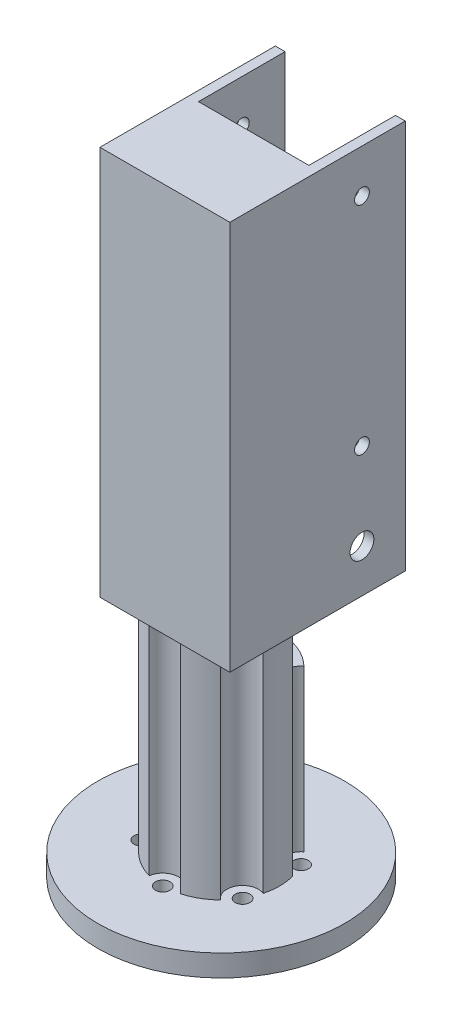
ISO-10303-21;
HEADER;
FILE_DESCRIPTION(('STEP AP214'),'2;1');
FILE_NAME('part.step','',(''),(''),'','','');
FILE_SCHEMA(('AUTOMOTIVE_DESIGN { 1 0 10303 214 1 1 1 1 }'));
ENDSEC;
DATA;
#1=APPLICATION_CONTEXT('core data for automotive mechanical design processes');
#2=APPLICATION_PROTOCOL_DEFINITION('international standard','automotive_design',2000,#1);
#3=PRODUCT_CONTEXT('',#1,'mechanical');
#4=PRODUCT('Part','Part','',(#3));
#5=PRODUCT_RELATED_PRODUCT_CATEGORY('part','',(#4));
#6=PRODUCT_DEFINITION_FORMATION('','',#4);
#7=PRODUCT_DEFINITION_CONTEXT('part definition',#1,'design');
#8=PRODUCT_DEFINITION('design','',#6,#7);
#9=PRODUCT_DEFINITION_SHAPE('','',#8);
#10=(LENGTH_UNIT() NAMED_UNIT(*) SI_UNIT(.MILLI.,.METRE.));
#11=(NAMED_UNIT(*) PLANE_ANGLE_UNIT() SI_UNIT($,.RADIAN.));
#12=(NAMED_UNIT(*) SI_UNIT($,.STERADIAN.) SOLID_ANGLE_UNIT());
#13=UNCERTAINTY_MEASURE_WITH_UNIT(LENGTH_MEASURE(1.E-05),#10,'distance_accuracy_value','');
#14=(GEOMETRIC_REPRESENTATION_CONTEXT(3) GLOBAL_UNCERTAINTY_ASSIGNED_CONTEXT((#13)) GLOBAL_UNIT_ASSIGNED_CONTEXT((#10,
#11,#12)) REPRESENTATION_CONTEXT('',''));
#15=CARTESIAN_POINT('',(0.,0.,0.));
#16=DIRECTION('',(0.,0.,1.));
#17=DIRECTION('',(1.,0.,0.));
#18=AXIS2_PLACEMENT_3D('',#15,#16,#17);
#19=CARTESIAN_POINT('',(0.,55.,0.));
#20=DIRECTION('',(0.,-1.,0.));
#21=DIRECTION('',(0.,0.,-1.));
#22=AXIS2_PLACEMENT_3D('',#19,#20,#21);
#23=PLANE('',#22);
#24=DIRECTION('',(1.,0.,0.));
#25=VECTOR('',#24,1.);
#26=CARTESIAN_POINT('',(16.9162294887037,55.,13.006574074074));
#27=LINE('',#26,#25);
#28=CARTESIAN_POINT('',(-15.,55.,13.006574074074));
#29=VERTEX_POINT('',#28);
#30=CARTESIAN_POINT('',(-3.61649427700658,55.,13.006574074074));
#31=VERTEX_POINT('',#30);
#32=EDGE_CURVE('E191',#29,#31,#27,.T.);
#33=ORIENTED_EDGE('',*,*,#32,.F.);
#34=DIRECTION('',(0.,0.,1.));
#35=VECTOR('',#34,1.);
#36=CARTESIAN_POINT('',(-15.,55.,27.5));
#37=LINE('',#36,#35);
#38=CARTESIAN_POINT('',(-15.,55.,-27.5));
#39=VERTEX_POINT('',#38);
#40=EDGE_CURVE('E203',#39,#29,#37,.T.);
#41=ORIENTED_EDGE('',*,*,#40,.F.);
#42=DIRECTION('',(-1.,0.,0.));
#43=VECTOR('',#42,1.);
#44=CARTESIAN_POINT('',(-15.,55.,-27.5));
#45=LINE('',#44,#43);
#46=CARTESIAN_POINT('',(-12.75,55.,-27.5));
#47=VERTEX_POINT('',#46);
#48=EDGE_CURVE('E226',#47,#39,#45,.T.);
#49=ORIENTED_EDGE('',*,*,#48,.F.);
#50=DIRECTION('',(0.,0.,-1.));
#51=VECTOR('',#50,1.);
#52=CARTESIAN_POINT('',(-12.75,55.,0.));
#53=LINE('',#52,#51);
#54=CARTESIAN_POINT('',(-12.75,55.,-7.5));
#55=VERTEX_POINT('',#54);
#56=EDGE_CURVE('E415',#55,#47,#53,.T.);
#57=ORIENTED_EDGE('',*,*,#56,.F.);
#58=DIRECTION('',(-1.,0.,0.));
#59=VECTOR('',#58,1.);
#60=CARTESIAN_POINT('',(0.,55.,-7.5));
#61=LINE('',#60,#59);
#62=CARTESIAN_POINT('',(-8.11922873119178,55.,-7.5));
#63=VERTEX_POINT('',#62);
#64=EDGE_CURVE('E526',#63,#55,#61,.T.);
#65=ORIENTED_EDGE('',*,*,#64,.F.);
#66=CARTESIAN_POINT('',(-11.6913429510901,55.,-6.74999999999973));
#67=DIRECTION('',(0.,-1.,0.));
#68=DIRECTION('',(0.,0.,-1.));
#69=AXIS2_PLACEMENT_3D('',#66,#67,#68);
#70=CIRCLE('',#69,3.65);
#71=CARTESIAN_POINT('',(-13.0722707028558,55.,-3.37131112050767));
#72=VERTEX_POINT('',#71);
#73=EDGE_CURVE('E297',#63,#72,#70,.T.);
#74=ORIENTED_EDGE('',*,*,#73,.T.);
#75=CARTESIAN_POINT('',(0.,55.,0.));
#76=DIRECTION('',(0.,1.,0.));
#77=DIRECTION('',(0.,0.,1.));
#78=AXIS2_PLACEMENT_3D('',#75,#76,#77);
#79=CIRCLE('',#78,13.5);
#80=CARTESIAN_POINT('',(-13.0722707028556,55.,3.3713111205083));
#81=VERTEX_POINT('',#80);
#82=EDGE_CURVE('E311',#72,#81,#79,.T.);
#83=ORIENTED_EDGE('',*,*,#82,.T.);
#84=CARTESIAN_POINT('',(-11.6913429510898,55.,6.7500000000003));
#85=DIRECTION('',(0.,1.,0.));
#86=DIRECTION('',(0.,0.,1.));
#87=AXIS2_PLACEMENT_3D('',#84,#85,#86);
#88=CIRCLE('',#87,3.65);
#89=CARTESIAN_POINT('',(-9.45577642584849,55.,9.63526295356634));
#90=VERTEX_POINT('',#89);
#91=EDGE_CURVE('E380',#90,#81,#88,.T.);
#92=ORIENTED_EDGE('',*,*,#91,.F.);
#93=EDGE_CURVE('E206',#90,#31,#79,.T.);
#94=ORIENTED_EDGE('',*,*,#93,.T.);
#95=EDGE_LOOP('',(#33,#41,#49,#57,#65,#74,#83,#92,#94));
#96=FACE_BOUND('',#95,.T.);
#97=ADVANCED_FACE('F41',(#96),#23,.T.);
#98=CARTESIAN_POINT('',(3.61649427700732,55.,13.006574074074));
#99=VERTEX_POINT('',#98);
#100=EDGE_CURVE('E208',#31,#99,#27,.T.);
#101=ORIENTED_EDGE('',*,*,#100,.F.);
#102=CARTESIAN_POINT('',(3.72098185597025E-13,55.,13.5));
#103=DIRECTION('',(0.,1.,0.));
#104=DIRECTION('',(0.,0.,1.));
#105=AXIS2_PLACEMENT_3D('',#102,#103,#104);
#106=CIRCLE('',#105,3.65);
#107=EDGE_CURVE('E382',#99,#31,#106,.T.);
#108=ORIENTED_EDGE('',*,*,#107,.F.);
#109=EDGE_LOOP('',(#101,#108));
#110=FACE_BOUND('',#109,.T.);
#111=ADVANCED_FACE('F606',(#110),#23,.T.);
#112=CARTESIAN_POINT('',(-15.,145.,-27.5));
#113=DIRECTION('',(0.,0.,1.));
#114=DIRECTION('',(1.,0.,0.));
#115=AXIS2_PLACEMENT_3D('',#112,#113,#114);
#116=PLANE('',#115);
#117=CARTESIAN_POINT('',(15.,55.,-27.5));
#118=VERTEX_POINT('',#117);
#119=CARTESIAN_POINT('',(12.75,55.,-27.5));
#120=VERTEX_POINT('',#119);
#121=EDGE_CURVE('E217',#118,#120,#45,.T.);
#122=ORIENTED_EDGE('',*,*,#121,.T.);
#123=DIRECTION('',(0.,-1.,0.));
#124=VECTOR('',#123,1.);
#125=CARTESIAN_POINT('',(12.75,152.987289477125,-27.5));
#126=LINE('',#125,#124);
#127=CARTESIAN_POINT('',(12.75,145.,-27.5));
#128=VERTEX_POINT('',#127);
#129=EDGE_CURVE('E577',#128,#120,#126,.T.);
#130=ORIENTED_EDGE('',*,*,#129,.F.);
#131=DIRECTION('',(-1.,0.,0.));
#132=VECTOR('',#131,1.);
#133=CARTESIAN_POINT('',(-15.,145.,-27.5));
#134=LINE('',#133,#132);
#135=CARTESIAN_POINT('',(15.,145.,-27.5));
#136=VERTEX_POINT('',#135);
#137=EDGE_CURVE('E509',#136,#128,#134,.T.);
#138=ORIENTED_EDGE('',*,*,#137,.F.);
#139=DIRECTION('',(0.,-1.,0.));
#140=VECTOR('',#139,1.);
#141=CARTESIAN_POINT('',(15.,145.,-27.5));
#142=LINE('',#141,#140);
#143=EDGE_CURVE('E232',#136,#118,#142,.T.);
#144=ORIENTED_EDGE('',*,*,#143,.T.);
#145=EDGE_LOOP('',(#122,#130,#138,#144));
#146=FACE_BOUND('',#145,.T.);
#147=ADVANCED_FACE('F611',(#146),#116,.F.);
#148=CARTESIAN_POINT('',(-35.,85.,-17.5));
#149=DIRECTION('',(1.,0.,0.));
#150=DIRECTION('',(0.,0.,-1.));
#151=AXIS2_PLACEMENT_3D('',#148,#149,#150);
#152=CYLINDRICAL_SURFACE('',#151,1.7);
#153=CARTESIAN_POINT('',(12.75,85.,-17.5));
#154=DIRECTION('',(1.,0.,0.));
#155=DIRECTION('',(0.,0.,-1.));
#156=AXIS2_PLACEMENT_3D('',#153,#154,#155);
#157=CIRCLE('',#156,1.7);
#158=CARTESIAN_POINT('',(12.75,85.,-19.2));
#159=VERTEX_POINT('',#158);
#160=EDGE_CURVE('E541',#159,#159,#157,.F.);
#161=ORIENTED_EDGE('',*,*,#160,.T.);
#162=EDGE_LOOP('',(#161));
#163=FACE_BOUND('',#162,.T.);
#164=CARTESIAN_POINT('',(15.,85.,-17.5));
#165=DIRECTION('',(1.,0.,0.));
#166=DIRECTION('',(0.,0.,-1.));
#167=AXIS2_PLACEMENT_3D('',#164,#165,#166);
#168=CIRCLE('',#167,1.7);
#169=CARTESIAN_POINT('',(15.,85.,-19.2));
#170=VERTEX_POINT('',#169);
#171=EDGE_CURVE('E395',#170,#170,#168,.T.);
#172=ORIENTED_EDGE('',*,*,#171,.T.);
#173=EDGE_LOOP('',(#172));
#174=FACE_BOUND('',#173,.T.);
#175=ADVANCED_FACE('F792',(#163,#174),#152,.F.);
#176=CARTESIAN_POINT('',(-35.,65.,-17.5));
#177=DIRECTION('',(1.,0.,0.));
#178=DIRECTION('',(0.,0.,-1.));
#179=AXIS2_PLACEMENT_3D('',#176,#177,#178);
#180=CYLINDRICAL_SURFACE('',#179,2.75);
#181=CARTESIAN_POINT('',(12.75,65.,-17.5));
#182=DIRECTION('',(1.,0.,0.));
#183=DIRECTION('',(0.,0.,-1.));
#184=AXIS2_PLACEMENT_3D('',#181,#182,#183);
#185=CIRCLE('',#184,2.75);
#186=CARTESIAN_POINT('',(12.75,65.,-20.25));
#187=VERTEX_POINT('',#186);
#188=EDGE_CURVE('E414',#187,#187,#185,.F.);
#189=ORIENTED_EDGE('',*,*,#188,.T.);
#190=EDGE_LOOP('',(#189));
#191=FACE_BOUND('',#190,.T.);
#192=CARTESIAN_POINT('',(15.,65.,-17.5));
#193=DIRECTION('',(1.,0.,0.));
#194=DIRECTION('',(0.,0.,-1.));
#195=AXIS2_PLACEMENT_3D('',#192,#193,#194);
#196=CIRCLE('',#195,2.75);
#197=CARTESIAN_POINT('',(15.,65.,-20.25));
#198=VERTEX_POINT('',#197);
#199=EDGE_CURVE('E500',#198,#198,#196,.T.);
#200=ORIENTED_EDGE('',*,*,#199,.T.);
#201=EDGE_LOOP('',(#200));
#202=FACE_BOUND('',#201,.T.);
#203=ADVANCED_FACE('F802',(#191,#202),#180,.F.);
#204=CARTESIAN_POINT('',(-35.,135.,-17.5));
#205=DIRECTION('',(1.,0.,0.));
#206=DIRECTION('',(0.,0.,-1.));
#207=AXIS2_PLACEMENT_3D('',#204,#205,#206);
#208=CYLINDRICAL_SURFACE('',#207,1.7);
#209=CARTESIAN_POINT('',(12.75,135.,-17.5));
#210=DIRECTION('',(1.,0.,0.));
#211=DIRECTION('',(0.,0.,-1.));
#212=AXIS2_PLACEMENT_3D('',#209,#210,#211);
#213=CIRCLE('',#212,1.7);
#214=CARTESIAN_POINT('',(12.75,135.,-19.2));
#215=VERTEX_POINT('',#214);
#216=EDGE_CURVE('E410',#215,#215,#213,.F.);
#217=ORIENTED_EDGE('',*,*,#216,.T.);
#218=EDGE_LOOP('',(#217));
#219=FACE_BOUND('',#218,.T.);
#220=CARTESIAN_POINT('',(15.,135.,-17.5));
#221=DIRECTION('',(1.,0.,0.));
#222=DIRECTION('',(0.,0.,-1.));
#223=AXIS2_PLACEMENT_3D('',#220,#221,#222);
#224=CIRCLE('',#223,1.7);
#225=CARTESIAN_POINT('',(15.,135.,-19.2));
#226=VERTEX_POINT('',#225);
#227=EDGE_CURVE('E401',#226,#226,#224,.T.);
#228=ORIENTED_EDGE('',*,*,#227,.T.);
#229=EDGE_LOOP('',(#228));
#230=FACE_BOUND('',#229,.T.);
#231=ADVANCED_FACE('F811',(#219,#230),#208,.F.);
#232=CARTESIAN_POINT('',(0.,55.,0.));
#233=DIRECTION('',(0.,-1.,0.));
#234=DIRECTION('',(0.,0.,-1.));
#235=AXIS2_PLACEMENT_3D('',#232,#233,#234);
#236=CYLINDRICAL_SURFACE('',#235,13.5);
#237=DIRECTION('',(0.,-1.,0.));
#238=VECTOR('',#237,1.);
#239=CARTESIAN_POINT('',(3.61649427700652,30.,-13.0065740740742));
#240=LINE('',#239,#238);
#241=CARTESIAN_POINT('',(3.61649427700652,5.,-13.0065740740742));
#242=VERTEX_POINT('',#241);
#243=CARTESIAN_POINT('',(3.61649427700652,42.1437527992613,-13.0065740740742));
#244=VERTEX_POINT('',#243);
#245=EDGE_CURVE('E292',#242,#244,#240,.F.);
#246=ORIENTED_EDGE('',*,*,#245,.T.);
#247=CARTESIAN_POINT('',(0.,42.1437527992613,0.));
#248=DIRECTION('',(0.,-1.,0.));
#249=DIRECTION('',(0.,0.,-1.));
#250=AXIS2_PLACEMENT_3D('',#247,#248,#249);
#251=CIRCLE('',#250,13.5);
#252=CARTESIAN_POINT('',(9.45577642584842,42.1437527992613,-9.63526295356641));
#253=VERTEX_POINT('',#252);
#254=EDGE_CURVE('E429',#244,#253,#251,.T.);
#255=ORIENTED_EDGE('',*,*,#254,.T.);
#256=DIRECTION('',(0.,-1.,0.));
#257=VECTOR('',#256,1.);
#258=CARTESIAN_POINT('',(9.45577642584842,30.,-9.63526295356641));
#259=LINE('',#258,#257);
#260=CARTESIAN_POINT('',(9.45577642584842,5.,-9.63526295356641));
#261=VERTEX_POINT('',#260);
#262=EDGE_CURVE('E282',#253,#261,#259,.T.);
#263=ORIENTED_EDGE('',*,*,#262,.T.);
#264=CARTESIAN_POINT('',(0.,5.,0.));
#265=DIRECTION('',(0.,1.,0.));
#266=DIRECTION('',(0.,0.,1.));
#267=AXIS2_PLACEMENT_3D('',#264,#265,#266);
#268=CIRCLE('',#267,13.5);
#269=EDGE_CURVE('E317',#261,#242,#268,.T.);
#270=ORIENTED_EDGE('',*,*,#269,.T.);
#271=EDGE_LOOP('',(#246,#255,#263,#270));
#272=FACE_BOUND('',#271,.T.);
#273=ADVANCED_FACE('F428',(#272),#236,.T.);
#274=CARTESIAN_POINT('',(13.0722707028558,5.,3.37131112050758));
#275=VERTEX_POINT('',#274);
#276=CARTESIAN_POINT('',(13.0722707028556,5.,-3.37131112050838));
#277=VERTEX_POINT('',#276);
#278=EDGE_CURVE('E321',#275,#277,#268,.T.);
#279=ORIENTED_EDGE('',*,*,#278,.T.);
#280=DIRECTION('',(0.,-1.,0.));
#281=VECTOR('',#280,1.);
#282=CARTESIAN_POINT('',(13.0722707028556,30.,-3.37131112050838));
#283=LINE('',#282,#281);
#284=CARTESIAN_POINT('',(13.0722707028556,55.,-3.37131112050838));
#285=VERTEX_POINT('',#284);
#286=EDGE_CURVE('E285',#277,#285,#283,.F.);
#287=ORIENTED_EDGE('',*,*,#286,.T.);
#288=CARTESIAN_POINT('',(13.0722707028558,55.,3.37131112050758));
#289=VERTEX_POINT('',#288);
#290=EDGE_CURVE('E316',#289,#285,#79,.T.);
#291=ORIENTED_EDGE('',*,*,#290,.F.);
#292=DIRECTION('',(0.,-1.,0.));
#293=VECTOR('',#292,1.);
#294=CARTESIAN_POINT('',(13.0722707028558,30.,3.37131112050758));
#295=LINE('',#294,#293);
#296=EDGE_CURVE('E274',#289,#275,#295,.T.);
#297=ORIENTED_EDGE('',*,*,#296,.T.);
#298=EDGE_LOOP('',(#279,#287,#291,#297));
#299=FACE_BOUND('',#298,.T.);
#300=ADVANCED_FACE('F461',(#299),#236,.T.);
#301=CARTESIAN_POINT('',(3.61649427700733,5.,13.006574074074));
#302=VERTEX_POINT('',#301);
#303=CARTESIAN_POINT('',(9.45577642584902,5.,9.63526295356582));
#304=VERTEX_POINT('',#303);
#305=EDGE_CURVE('E310',#302,#304,#268,.T.);
#306=ORIENTED_EDGE('',*,*,#305,.T.);
#307=DIRECTION('',(0.,-1.,0.));
#308=VECTOR('',#307,1.);
#309=CARTESIAN_POINT('',(9.45577642584902,30.,9.63526295356582));
#310=LINE('',#309,#308);
#311=CARTESIAN_POINT('',(9.45577642584902,55.,9.63526295356582));
#312=VERTEX_POINT('',#311);
#313=EDGE_CURVE('E278',#304,#312,#310,.F.);
#314=ORIENTED_EDGE('',*,*,#313,.T.);
#315=EDGE_CURVE('E457',#99,#312,#79,.T.);
#316=ORIENTED_EDGE('',*,*,#315,.F.);
#317=DIRECTION('',(0.,-1.,0.));
#318=VECTOR('',#317,1.);
#319=CARTESIAN_POINT('',(3.61649427700733,30.,13.006574074074));
#320=LINE('',#319,#318);
#321=EDGE_CURVE('E266',#99,#302,#320,.T.);
#322=ORIENTED_EDGE('',*,*,#321,.T.);
#323=EDGE_LOOP('',(#306,#314,#316,#322));
#324=FACE_BOUND('',#323,.T.);
#325=ADVANCED_FACE('F470',(#324),#236,.T.);
#326=CARTESIAN_POINT('',(-9.45577642584849,5.,9.63526295356635));
#327=VERTEX_POINT('',#326);
#328=CARTESIAN_POINT('',(-3.61649427700661,5.,13.0065740740742));
#329=VERTEX_POINT('',#328);
#330=EDGE_CURVE('E376',#327,#329,#268,.T.);
#331=ORIENTED_EDGE('',*,*,#330,.T.);
#332=DIRECTION('',(0.,-1.,0.));
#333=VECTOR('',#332,1.);
#334=CARTESIAN_POINT('',(-3.61649427700661,30.,13.0065740740742));
#335=LINE('',#334,#333);
#336=EDGE_CURVE('E270',#329,#31,#335,.F.);
#337=ORIENTED_EDGE('',*,*,#336,.T.);
#338=ORIENTED_EDGE('',*,*,#93,.F.);
#339=DIRECTION('',(0.,-1.,0.));
#340=VECTOR('',#339,1.);
#341=CARTESIAN_POINT('',(-9.45577642584848,30.,9.63526295356634));
#342=LINE('',#341,#340);
#343=EDGE_CURVE('E256',#90,#327,#342,.T.);
#344=ORIENTED_EDGE('',*,*,#343,.T.);
#345=EDGE_LOOP('',(#331,#337,#338,#344));
#346=FACE_BOUND('',#345,.T.);
#347=ADVANCED_FACE('F959',(#346),#236,.T.);
#348=CARTESIAN_POINT('',(-13.0722707028558,5.,-3.37131112050767));
#349=VERTEX_POINT('',#348);
#350=CARTESIAN_POINT('',(-13.0722707028556,5.,3.3713111205083));
#351=VERTEX_POINT('',#350);
#352=EDGE_CURVE('E323',#349,#351,#268,.T.);
#353=ORIENTED_EDGE('',*,*,#352,.T.);
#354=DIRECTION('',(0.,-1.,0.));
#355=VECTOR('',#354,1.);
#356=CARTESIAN_POINT('',(-13.0722707028556,30.,3.3713111205083));
#357=LINE('',#356,#355);
#358=EDGE_CURVE('E262',#351,#81,#357,.F.);
#359=ORIENTED_EDGE('',*,*,#358,.T.);
#360=ORIENTED_EDGE('',*,*,#82,.F.);
#361=DIRECTION('',(0.,-1.,0.));
#362=VECTOR('',#361,1.);
#363=CARTESIAN_POINT('',(-13.0722707028558,30.,-3.37131112050767));
#364=LINE('',#363,#362);
#365=EDGE_CURVE('E300',#72,#349,#364,.T.);
#366=ORIENTED_EDGE('',*,*,#365,.T.);
#367=EDGE_LOOP('',(#353,#359,#360,#366));
#368=FACE_BOUND('',#367,.T.);
#369=ADVANCED_FACE('F645',(#368),#236,.T.);
#370=CARTESIAN_POINT('',(0.,5.,0.));
#371=DIRECTION('',(0.,1.,0.));
#372=DIRECTION('',(0.,0.,1.));
#373=AXIS2_PLACEMENT_3D('',#370,#371,#372);
#374=PLANE('',#373);
#375=CARTESIAN_POINT('',(-3.61649427700741,5.,-13.0065740740739));
#376=VERTEX_POINT('',#375);
#377=CARTESIAN_POINT('',(-9.45577642584895,5.,-9.63526295356589));
#378=VERTEX_POINT('',#377);
#379=EDGE_CURVE('E322',#376,#378,#268,.T.);
#380=ORIENTED_EDGE('',*,*,#379,.F.);
#381=CARTESIAN_POINT('',(-4.64905891561784E-13,5.,-13.5));
#382=DIRECTION('',(0.,-1.,0.));
#383=DIRECTION('',(0.,0.,-1.));
#384=AXIS2_PLACEMENT_3D('',#381,#382,#383);
#385=CIRCLE('',#384,3.65);
#386=EDGE_CURVE('E237',#242,#376,#385,.T.);
#387=ORIENTED_EDGE('',*,*,#386,.F.);
#388=ORIENTED_EDGE('',*,*,#269,.F.);
#389=CARTESIAN_POINT('',(11.6913429510897,5.,-6.75000000000037));
#390=DIRECTION('',(0.,-1.,0.));
#391=DIRECTION('',(0.,0.,-1.));
#392=AXIS2_PLACEMENT_3D('',#389,#390,#391);
#393=CIRCLE('',#392,3.65);
#394=EDGE_CURVE('E246',#277,#261,#393,.T.);
#395=ORIENTED_EDGE('',*,*,#394,.F.);
#396=ORIENTED_EDGE('',*,*,#278,.F.);
#397=CARTESIAN_POINT('',(11.6913429510901,5.,6.74999999999965));
#398=DIRECTION('',(0.,-1.,0.));
#399=DIRECTION('',(0.,0.,-1.));
#400=AXIS2_PLACEMENT_3D('',#397,#398,#399);
#401=CIRCLE('',#400,3.65);
#402=EDGE_CURVE('E238',#304,#275,#401,.T.);
#403=ORIENTED_EDGE('',*,*,#402,.F.);
#404=ORIENTED_EDGE('',*,*,#305,.F.);
#405=CARTESIAN_POINT('',(3.72098185597025E-13,5.,13.5));
#406=DIRECTION('',(0.,-1.,0.));
#407=DIRECTION('',(0.,0.,-1.));
#408=AXIS2_PLACEMENT_3D('',#405,#406,#407);
#409=CIRCLE('',#408,3.65);
#410=EDGE_CURVE('E241',#329,#302,#409,.T.);
#411=ORIENTED_EDGE('',*,*,#410,.F.);
#412=ORIENTED_EDGE('',*,*,#330,.F.);
#413=CARTESIAN_POINT('',(-11.6913429510898,5.,6.7500000000003));
#414=DIRECTION('',(0.,-1.,0.));
#415=DIRECTION('',(0.,0.,-1.));
#416=AXIS2_PLACEMENT_3D('',#413,#414,#415);
#417=CIRCLE('',#416,3.65);
#418=EDGE_CURVE('E253',#351,#327,#417,.T.);
#419=ORIENTED_EDGE('',*,*,#418,.F.);
#420=ORIENTED_EDGE('',*,*,#352,.F.);
#421=CARTESIAN_POINT('',(-11.6913429510901,5.,-6.74999999999973));
#422=DIRECTION('',(0.,-1.,0.));
#423=DIRECTION('',(0.,0.,-1.));
#424=AXIS2_PLACEMENT_3D('',#421,#422,#423);
#425=CIRCLE('',#424,3.65);
#426=EDGE_CURVE('E296',#378,#349,#425,.T.);
#427=ORIENTED_EDGE('',*,*,#426,.F.);
#428=EDGE_LOOP('',(#380,#387,#388,#395,#396,#403,#404,#411,#412,#419,#420,#427));
#429=FACE_BOUND('',#428,.T.);
#430=CARTESIAN_POINT('',(0.,5.,0.));
#431=DIRECTION('',(0.,1.,0.));
#432=DIRECTION('',(0.,0.,1.));
#433=AXIS2_PLACEMENT_3D('',#430,#431,#432);
#434=CIRCLE('',#433,28.5);
#435=CARTESIAN_POINT('',(0.,5.,28.5));
#436=VERTEX_POINT('',#435);
#437=EDGE_CURVE('E372',#436,#436,#434,.T.);
#438=ORIENTED_EDGE('',*,*,#437,.T.);
#439=EDGE_LOOP('',(#438));
#440=FACE_BOUND('',#439,.T.);
#441=CARTESIAN_POINT('',(-11.6913429510896,5.,-6.74999999999949));
#442=DIRECTION('',(0.,1.,0.));
#443=DIRECTION('',(0.,0.,1.));
#444=AXIS2_PLACEMENT_3D('',#441,#442,#443);
#445=CIRCLE('',#444,1.70000000000058);
#446=CARTESIAN_POINT('',(-11.6913429510896,5.,-5.04999999999891));
#447=VERTEX_POINT('',#446);
#448=EDGE_CURVE('E324',#447,#447,#445,.T.);
#449=ORIENTED_EDGE('',*,*,#448,.F.);
#450=EDGE_LOOP('',(#449));
#451=FACE_BOUND('',#450,.T.);
#452=CARTESIAN_POINT('',(-11.6913429510891,5.,6.7500000000005));
#453=DIRECTION('',(0.,1.,0.));
#454=DIRECTION('',(0.,0.,1.));
#455=AXIS2_PLACEMENT_3D('',#452,#453,#454);
#456=CIRCLE('',#455,1.70000000000109);
#457=CARTESIAN_POINT('',(-11.6913429510891,5.,8.45000000000159));
#458=VERTEX_POINT('',#457);
#459=EDGE_CURVE('E332',#458,#458,#456,.T.);
#460=ORIENTED_EDGE('',*,*,#459,.F.);
#461=EDGE_LOOP('',(#460));
#462=FACE_BOUND('',#461,.T.);
#463=CARTESIAN_POINT('',(1.14777268557366E-12,5.,13.5));
#464=DIRECTION('',(0.,1.,0.));
#465=DIRECTION('',(0.,0.,1.));
#466=AXIS2_PLACEMENT_3D('',#463,#464,#465);
#467=CIRCLE('',#466,1.70000000000119);
#468=CARTESIAN_POINT('',(1.14777268557366E-12,5.,15.2000000000012));
#469=VERTEX_POINT('',#468);
#470=EDGE_CURVE('E340',#469,#469,#467,.T.);
#471=ORIENTED_EDGE('',*,*,#470,.F.);
#472=EDGE_LOOP('',(#471));
#473=FACE_BOUND('',#472,.T.);
#474=CARTESIAN_POINT('',(11.6913429510908,5.,6.7499999999995));
#475=DIRECTION('',(0.,1.,0.));
#476=DIRECTION('',(0.,0.,1.));
#477=AXIS2_PLACEMENT_3D('',#474,#475,#476);
#478=CIRCLE('',#477,1.70000000000074);
#479=CARTESIAN_POINT('',(11.6913429510908,5.,8.45000000000024));
#480=VERTEX_POINT('',#479);
#481=EDGE_CURVE('E348',#480,#480,#478,.T.);
#482=ORIENTED_EDGE('',*,*,#481,.F.);
#483=EDGE_LOOP('',(#482));
#484=FACE_BOUND('',#483,.T.);
#485=CARTESIAN_POINT('',(11.6913429510899,5.,-6.74999999999997));
#486=DIRECTION('',(0.,1.,0.));
#487=DIRECTION('',(0.,0.,1.));
#488=AXIS2_PLACEMENT_3D('',#485,#486,#487);
#489=CIRCLE('',#488,1.7);
#490=CARTESIAN_POINT('',(11.6913429510899,5.,-5.04999999999998));
#491=VERTEX_POINT('',#490);
#492=EDGE_CURVE('E356',#491,#491,#489,.T.);
#493=ORIENTED_EDGE('',*,*,#492,.F.);
#494=EDGE_LOOP('',(#493));
#495=FACE_BOUND('',#494,.T.);
#496=CARTESIAN_POINT('',(0.,5.,-13.5));
#497=DIRECTION('',(0.,1.,0.));
#498=DIRECTION('',(0.,0.,1.));
#499=AXIS2_PLACEMENT_3D('',#496,#497,#498);
#500=CIRCLE('',#499,1.7);
#501=CARTESIAN_POINT('',(0.,5.,-11.8));
#502=VERTEX_POINT('',#501);
#503=EDGE_CURVE('E364',#502,#502,#500,.T.);
#504=ORIENTED_EDGE('',*,*,#503,.F.);
#505=EDGE_LOOP('',(#504));
#506=FACE_BOUND('',#505,.T.);
#507=ADVANCED_FACE('F435',(#429,#440,#451,#462,#473,#484,#495,#506),#374,.T.);
#508=CARTESIAN_POINT('',(0.,0.,0.));
#509=DIRECTION('',(0.,1.,0.));
#510=DIRECTION('',(0.,0.,1.));
#511=AXIS2_PLACEMENT_3D('',#508,#509,#510);
#512=PLANE('',#511);
#513=CARTESIAN_POINT('',(0.,0.,0.));
#514=DIRECTION('',(0.,1.,0.));
#515=DIRECTION('',(0.,0.,1.));
#516=AXIS2_PLACEMENT_3D('',#513,#514,#515);
#517=CIRCLE('',#516,28.5);
#518=CARTESIAN_POINT('',(0.,0.,28.5));
#519=VERTEX_POINT('',#518);
#520=EDGE_CURVE('E368',#519,#519,#517,.T.);
#521=ORIENTED_EDGE('',*,*,#520,.F.);
#522=EDGE_LOOP('',(#521));
#523=FACE_BOUND('',#522,.T.);
#524=CARTESIAN_POINT('',(0.,0.,-13.5));
#525=DIRECTION('',(0.,1.,0.));
#526=DIRECTION('',(0.,0.,1.));
#527=AXIS2_PLACEMENT_3D('',#524,#525,#526);
#528=CIRCLE('',#527,1.7);
#529=CARTESIAN_POINT('',(0.,0.,-11.8));
#530=VERTEX_POINT('',#529);
#531=EDGE_CURVE('E360',#530,#530,#528,.T.);
#532=ORIENTED_EDGE('',*,*,#531,.T.);
#533=EDGE_LOOP('',(#532));
#534=FACE_BOUND('',#533,.T.);
#535=CARTESIAN_POINT('',(11.6913429510899,0.,-6.74999999999997));
#536=DIRECTION('',(0.,1.,0.));
#537=DIRECTION('',(0.,0.,1.));
#538=AXIS2_PLACEMENT_3D('',#535,#536,#537);
#539=CIRCLE('',#538,1.7);
#540=CARTESIAN_POINT('',(11.6913429510899,0.,-5.04999999999998));
#541=VERTEX_POINT('',#540);
#542=EDGE_CURVE('E352',#541,#541,#539,.T.);
#543=ORIENTED_EDGE('',*,*,#542,.T.);
#544=EDGE_LOOP('',(#543));
#545=FACE_BOUND('',#544,.T.);
#546=CARTESIAN_POINT('',(11.6913429510908,0.,6.7499999999995));
#547=DIRECTION('',(0.,1.,0.));
#548=DIRECTION('',(0.,0.,1.));
#549=AXIS2_PLACEMENT_3D('',#546,#547,#548);
#550=CIRCLE('',#549,1.70000000000074);
#551=CARTESIAN_POINT('',(11.6913429510908,0.,8.45000000000024));
#552=VERTEX_POINT('',#551);
#553=EDGE_CURVE('E344',#552,#552,#550,.T.);
#554=ORIENTED_EDGE('',*,*,#553,.T.);
#555=EDGE_LOOP('',(#554));
#556=FACE_BOUND('',#555,.T.);
#557=CARTESIAN_POINT('',(1.14777268557366E-12,0.,13.5));
#558=DIRECTION('',(0.,1.,0.));
#559=DIRECTION('',(0.,0.,1.));
#560=AXIS2_PLACEMENT_3D('',#557,#558,#559);
#561=CIRCLE('',#560,1.70000000000119);
#562=CARTESIAN_POINT('',(1.14777268557366E-12,0.,15.2000000000012));
#563=VERTEX_POINT('',#562);
#564=EDGE_CURVE('E336',#563,#563,#561,.T.);
#565=ORIENTED_EDGE('',*,*,#564,.T.);
#566=EDGE_LOOP('',(#565));
#567=FACE_BOUND('',#566,.T.);
#568=CARTESIAN_POINT('',(-11.6913429510891,0.,6.7500000000005));
#569=DIRECTION('',(0.,1.,0.));
#570=DIRECTION('',(0.,0.,1.));
#571=AXIS2_PLACEMENT_3D('',#568,#569,#570);
#572=CIRCLE('',#571,1.70000000000109);
#573=CARTESIAN_POINT('',(-11.6913429510891,0.,8.45000000000159));
#574=VERTEX_POINT('',#573);
#575=EDGE_CURVE('E328',#574,#574,#572,.T.);
#576=ORIENTED_EDGE('',*,*,#575,.T.);
#577=EDGE_LOOP('',(#576));
#578=FACE_BOUND('',#577,.T.);
#579=CARTESIAN_POINT('',(-11.6913429510896,0.,-6.74999999999949));
#580=DIRECTION('',(0.,1.,0.));
#581=DIRECTION('',(0.,0.,1.));
#582=AXIS2_PLACEMENT_3D('',#579,#580,#581);
#583=CIRCLE('',#582,1.70000000000058);
#584=CARTESIAN_POINT('',(-11.6913429510896,0.,-5.04999999999891));
#585=VERTEX_POINT('',#584);
#586=EDGE_CURVE('E315',#585,#585,#583,.T.);
#587=ORIENTED_EDGE('',*,*,#586,.T.);
#588=EDGE_LOOP('',(#587));
#589=FACE_BOUND('',#588,.T.);
#590=ADVANCED_FACE('F670',(#523,#534,#545,#556,#567,#578,#589),#512,.F.);
#591=CARTESIAN_POINT('',(0.,5.,0.));
#592=DIRECTION('',(0.,-1.,0.));
#593=DIRECTION('',(0.,0.,-1.));
#594=AXIS2_PLACEMENT_3D('',#591,#592,#593);
#595=CYLINDRICAL_SURFACE('',#594,28.5);
#596=ORIENTED_EDGE('',*,*,#437,.F.);
#597=EDGE_LOOP('',(#596));
#598=FACE_BOUND('',#597,.T.);
#599=ORIENTED_EDGE('',*,*,#520,.T.);
#600=EDGE_LOOP('',(#599));
#601=FACE_BOUND('',#600,.T.);
#602=ADVANCED_FACE('F43',(#598,#601),#595,.T.);
#603=CARTESIAN_POINT('',(0.,5.,-13.5));
#604=DIRECTION('',(0.,-1.,0.));
#605=DIRECTION('',(0.,0.,-1.));
#606=AXIS2_PLACEMENT_3D('',#603,#604,#605);
#607=CYLINDRICAL_SURFACE('',#606,1.7);
#608=ORIENTED_EDGE('',*,*,#503,.T.);
#609=EDGE_LOOP('',(#608));
#610=FACE_BOUND('',#609,.T.);
#611=ORIENTED_EDGE('',*,*,#531,.F.);
#612=EDGE_LOOP('',(#611));
#613=FACE_BOUND('',#612,.T.);
#614=ADVANCED_FACE('F664',(#610,#613),#607,.F.);
#615=CARTESIAN_POINT('',(11.6913429510899,5.,-6.74999999999997));
#616=DIRECTION('',(0.,-1.,0.));
#617=DIRECTION('',(0.,0.,-1.));
#618=AXIS2_PLACEMENT_3D('',#615,#616,#617);
#619=CYLINDRICAL_SURFACE('',#618,1.7);
#620=ORIENTED_EDGE('',*,*,#492,.T.);
#621=EDGE_LOOP('',(#620));
#622=FACE_BOUND('',#621,.T.);
#623=ORIENTED_EDGE('',*,*,#542,.F.);
#624=EDGE_LOOP('',(#623));
#625=FACE_BOUND('',#624,.T.);
#626=ADVANCED_FACE('F660',(#622,#625),#619,.F.);
#627=CARTESIAN_POINT('',(11.6913429510908,5.,6.7499999999995));
#628=DIRECTION('',(0.,-1.,0.));
#629=DIRECTION('',(0.,0.,-1.));
#630=AXIS2_PLACEMENT_3D('',#627,#628,#629);
#631=CYLINDRICAL_SURFACE('',#630,1.70000000000074);
#632=ORIENTED_EDGE('',*,*,#481,.T.);
#633=EDGE_LOOP('',(#632));
#634=FACE_BOUND('',#633,.T.);
#635=ORIENTED_EDGE('',*,*,#553,.F.);
#636=EDGE_LOOP('',(#635));
#637=FACE_BOUND('',#636,.T.);
#638=ADVANCED_FACE('F656',(#634,#637),#631,.F.);
#639=CARTESIAN_POINT('',(1.14777268557366E-12,5.,13.5));
#640=DIRECTION('',(0.,-1.,0.));
#641=DIRECTION('',(0.,0.,-1.));
#642=AXIS2_PLACEMENT_3D('',#639,#640,#641);
#643=CYLINDRICAL_SURFACE('',#642,1.70000000000119);
#644=ORIENTED_EDGE('',*,*,#470,.T.);
#645=EDGE_LOOP('',(#644));
#646=FACE_BOUND('',#645,.T.);
#647=ORIENTED_EDGE('',*,*,#564,.F.);
#648=EDGE_LOOP('',(#647));
#649=FACE_BOUND('',#648,.T.);
#650=ADVANCED_FACE('F652',(#646,#649),#643,.F.);
#651=CARTESIAN_POINT('',(-11.6913429510891,5.,6.7500000000005));
#652=DIRECTION('',(0.,-1.,0.));
#653=DIRECTION('',(0.,0.,-1.));
#654=AXIS2_PLACEMENT_3D('',#651,#652,#653);
#655=CYLINDRICAL_SURFACE('',#654,1.70000000000109);
#656=ORIENTED_EDGE('',*,*,#459,.T.);
#657=EDGE_LOOP('',(#656));
#658=FACE_BOUND('',#657,.T.);
#659=ORIENTED_EDGE('',*,*,#575,.F.);
#660=EDGE_LOOP('',(#659));
#661=FACE_BOUND('',#660,.T.);
#662=ADVANCED_FACE('F648',(#658,#661),#655,.F.);
#663=CARTESIAN_POINT('',(-11.6913429510896,5.,-6.74999999999949));
#664=DIRECTION('',(0.,-1.,0.));
#665=DIRECTION('',(0.,0.,-1.));
#666=AXIS2_PLACEMENT_3D('',#663,#664,#665);
#667=CYLINDRICAL_SURFACE('',#666,1.70000000000058);
#668=ORIENTED_EDGE('',*,*,#448,.T.);
#669=EDGE_LOOP('',(#668));
#670=FACE_BOUND('',#669,.T.);
#671=ORIENTED_EDGE('',*,*,#586,.F.);
#672=EDGE_LOOP('',(#671));
#673=FACE_BOUND('',#672,.T.);
#674=ADVANCED_FACE('F644',(#670,#673),#667,.F.);
#675=DIRECTION('',(0.,-1.,0.));
#676=VECTOR('',#675,1.);
#677=CARTESIAN_POINT('',(-9.45577642584895,30.,-9.63526295356589));
#678=LINE('',#677,#676);
#679=CARTESIAN_POINT('',(-9.45577642584895,42.1437527992613,-9.63526295356589));
#680=VERTEX_POINT('',#679);
#681=EDGE_CURVE('E306',#378,#680,#678,.F.);
#682=ORIENTED_EDGE('',*,*,#681,.T.);
#683=CARTESIAN_POINT('',(0.,42.1437527992613,0.));
#684=DIRECTION('',(0.,-1.,0.));
#685=DIRECTION('',(0.,0.,-1.));
#686=AXIS2_PLACEMENT_3D('',#683,#684,#685);
#687=CIRCLE('',#686,13.5);
#688=CARTESIAN_POINT('',(-3.61649427700741,42.1437527992613,-13.006574074074));
#689=VERTEX_POINT('',#688);
#690=EDGE_CURVE('E481',#680,#689,#687,.T.);
#691=ORIENTED_EDGE('',*,*,#690,.T.);
#692=DIRECTION('',(0.,-1.,0.));
#693=VECTOR('',#692,1.);
#694=CARTESIAN_POINT('',(-3.61649427700741,30.,-13.006574074074));
#695=LINE('',#694,#693);
#696=EDGE_CURVE('E289',#689,#376,#695,.T.);
#697=ORIENTED_EDGE('',*,*,#696,.T.);
#698=ORIENTED_EDGE('',*,*,#379,.T.);
#699=EDGE_LOOP('',(#682,#691,#697,#698));
#700=FACE_BOUND('',#699,.T.);
#701=ADVANCED_FACE('F641',(#700),#236,.T.);
#702=CARTESIAN_POINT('',(-11.6913429510901,55.,-6.74999999999973));
#703=DIRECTION('',(0.,-1.,0.));
#704=DIRECTION('',(0.,0.,-1.));
#705=AXIS2_PLACEMENT_3D('',#702,#703,#704);
#706=CYLINDRICAL_SURFACE('',#705,3.65);
#707=DIRECTION('',(0.,-1.,0.));
#708=VECTOR('',#707,1.);
#709=CARTESIAN_POINT('',(-8.11922873119178,55.,-7.5));
#710=LINE('',#709,#708);
#711=CARTESIAN_POINT('',(-8.11922873119178,42.1437527992613,-7.5));
#712=VERTEX_POINT('',#711);
#713=EDGE_CURVE('E552',#63,#712,#710,.T.);
#714=ORIENTED_EDGE('',*,*,#713,.T.);
#715=CARTESIAN_POINT('',(-11.6913429510901,42.1437527992613,-6.74999999999973));
#716=DIRECTION('',(0.,-1.,0.));
#717=DIRECTION('',(0.,0.,-1.));
#718=AXIS2_PLACEMENT_3D('',#715,#716,#717);
#719=CIRCLE('',#718,3.65);
#720=EDGE_CURVE('E496',#712,#680,#719,.F.);
#721=ORIENTED_EDGE('',*,*,#720,.T.);
#722=ORIENTED_EDGE('',*,*,#681,.F.);
#723=ORIENTED_EDGE('',*,*,#426,.T.);
#724=ORIENTED_EDGE('',*,*,#365,.F.);
#725=ORIENTED_EDGE('',*,*,#73,.F.);
#726=EDGE_LOOP('',(#714,#721,#722,#723,#724,#725));
#727=FACE_BOUND('',#726,.T.);
#728=ADVANCED_FACE('F634',(#727),#706,.F.);
#729=CARTESIAN_POINT('',(-11.6913429510898,55.,6.7500000000003));
#730=DIRECTION('',(0.,-1.,0.));
#731=DIRECTION('',(0.,0.,-1.));
#732=AXIS2_PLACEMENT_3D('',#729,#730,#731);
#733=CYLINDRICAL_SURFACE('',#732,3.65);
#734=ORIENTED_EDGE('',*,*,#418,.T.);
#735=ORIENTED_EDGE('',*,*,#343,.F.);
#736=ORIENTED_EDGE('',*,*,#91,.T.);
#737=ORIENTED_EDGE('',*,*,#358,.F.);
#738=EDGE_LOOP('',(#734,#735,#736,#737));
#739=FACE_BOUND('',#738,.T.);
#740=ADVANCED_FACE('F630',(#739),#733,.F.);
#741=CARTESIAN_POINT('',(3.72098185597025E-13,55.,13.5));
#742=DIRECTION('',(0.,-1.,0.));
#743=DIRECTION('',(0.,0.,-1.));
#744=AXIS2_PLACEMENT_3D('',#741,#742,#743);
#745=CYLINDRICAL_SURFACE('',#744,3.65);
#746=ORIENTED_EDGE('',*,*,#410,.T.);
#747=ORIENTED_EDGE('',*,*,#321,.F.);
#748=ORIENTED_EDGE('',*,*,#107,.T.);
#749=ORIENTED_EDGE('',*,*,#336,.F.);
#750=EDGE_LOOP('',(#746,#747,#748,#749));
#751=FACE_BOUND('',#750,.T.);
#752=ADVANCED_FACE('F633',(#751),#745,.F.);
#753=CARTESIAN_POINT('',(11.6913429510901,55.,6.74999999999965));
#754=DIRECTION('',(0.,-1.,0.));
#755=DIRECTION('',(0.,0.,-1.));
#756=AXIS2_PLACEMENT_3D('',#753,#754,#755);
#757=CYLINDRICAL_SURFACE('',#756,3.65);
#758=ORIENTED_EDGE('',*,*,#402,.T.);
#759=ORIENTED_EDGE('',*,*,#296,.F.);
#760=CARTESIAN_POINT('',(11.6913429510901,55.,6.74999999999965));
#761=DIRECTION('',(0.,1.,0.));
#762=DIRECTION('',(0.,0.,1.));
#763=AXIS2_PLACEMENT_3D('',#760,#761,#762);
#764=CIRCLE('',#763,3.65);
#765=EDGE_CURVE('E386',#289,#312,#764,.T.);
#766=ORIENTED_EDGE('',*,*,#765,.T.);
#767=ORIENTED_EDGE('',*,*,#313,.F.);
#768=EDGE_LOOP('',(#758,#759,#766,#767));
#769=FACE_BOUND('',#768,.T.);
#770=ADVANCED_FACE('F466',(#769),#757,.F.);
#771=CARTESIAN_POINT('',(11.6913429510897,55.,-6.75000000000037));
#772=DIRECTION('',(0.,-1.,0.));
#773=DIRECTION('',(0.,0.,-1.));
#774=AXIS2_PLACEMENT_3D('',#771,#772,#773);
#775=CYLINDRICAL_SURFACE('',#774,3.65);
#776=ORIENTED_EDGE('',*,*,#262,.F.);
#777=CARTESIAN_POINT('',(11.6913429510897,42.1437527992613,-6.75000000000037));
#778=DIRECTION('',(0.,-1.,0.));
#779=DIRECTION('',(0.,0.,-1.));
#780=AXIS2_PLACEMENT_3D('',#777,#778,#779);
#781=CIRCLE('',#780,3.65);
#782=CARTESIAN_POINT('',(8.11922873119127,42.1437527992613,-7.5));
#783=VERTEX_POINT('',#782);
#784=EDGE_CURVE('E485',#253,#783,#781,.F.);
#785=ORIENTED_EDGE('',*,*,#784,.T.);
#786=DIRECTION('',(0.,-1.,0.));
#787=VECTOR('',#786,1.);
#788=CARTESIAN_POINT('',(8.11922873119127,55.,-7.5));
#789=LINE('',#788,#787);
#790=CARTESIAN_POINT('',(8.11922873119127,55.,-7.5));
#791=VERTEX_POINT('',#790);
#792=EDGE_CURVE('E482',#783,#791,#789,.F.);
#793=ORIENTED_EDGE('',*,*,#792,.T.);
#794=CARTESIAN_POINT('',(11.6913429510897,55.,-6.75000000000037));
#795=DIRECTION('',(0.,-1.,0.));
#796=DIRECTION('',(0.,0.,-1.));
#797=AXIS2_PLACEMENT_3D('',#794,#795,#796);
#798=CIRCLE('',#797,3.65);
#799=EDGE_CURVE('E242',#285,#791,#798,.T.);
#800=ORIENTED_EDGE('',*,*,#799,.F.);
#801=ORIENTED_EDGE('',*,*,#286,.F.);
#802=ORIENTED_EDGE('',*,*,#394,.T.);
#803=EDGE_LOOP('',(#776,#785,#793,#800,#801,#802));
#804=FACE_BOUND('',#803,.T.);
#805=ADVANCED_FACE('F566',(#804),#775,.F.);
#806=CARTESIAN_POINT('',(-4.64905891561784E-13,55.,-13.5));
#807=DIRECTION('',(0.,-1.,0.));
#808=DIRECTION('',(0.,0.,-1.));
#809=AXIS2_PLACEMENT_3D('',#806,#807,#808);
#810=CYLINDRICAL_SURFACE('',#809,3.65);
#811=ORIENTED_EDGE('',*,*,#696,.F.);
#812=CARTESIAN_POINT('',(-4.64905891561784E-13,42.1437527992613,-13.5));
#813=DIRECTION('',(0.,-1.,0.));
#814=DIRECTION('',(0.,0.,-1.));
#815=AXIS2_PLACEMENT_3D('',#812,#813,#814);
#816=CIRCLE('',#815,3.65);
#817=EDGE_CURVE('E50',#689,#244,#816,.F.);
#818=ORIENTED_EDGE('',*,*,#817,.T.);
#819=ORIENTED_EDGE('',*,*,#245,.F.);
#820=ORIENTED_EDGE('',*,*,#386,.T.);
#821=EDGE_LOOP('',(#811,#818,#819,#820));
#822=FACE_BOUND('',#821,.T.);
#823=ADVANCED_FACE('F422',(#822),#810,.F.);
#824=CARTESIAN_POINT('',(15.,55.,13.006574074074));
#825=VERTEX_POINT('',#824);
#826=EDGE_CURVE('E210',#99,#825,#27,.T.);
#827=ORIENTED_EDGE('',*,*,#826,.F.);
#828=ORIENTED_EDGE('',*,*,#315,.T.);
#829=ORIENTED_EDGE('',*,*,#765,.F.);
#830=ORIENTED_EDGE('',*,*,#290,.T.);
#831=ORIENTED_EDGE('',*,*,#799,.T.);
#832=CARTESIAN_POINT('',(12.75,55.,-7.5));
#833=VERTEX_POINT('',#832);
#834=EDGE_CURVE('E489',#833,#791,#61,.T.);
#835=ORIENTED_EDGE('',*,*,#834,.F.);
#836=DIRECTION('',(0.,0.,1.));
#837=VECTOR('',#836,1.);
#838=CARTESIAN_POINT('',(12.75,55.,0.));
#839=LINE('',#838,#837);
#840=EDGE_CURVE('E549',#120,#833,#839,.T.);
#841=ORIENTED_EDGE('',*,*,#840,.F.);
#842=ORIENTED_EDGE('',*,*,#121,.F.);
#843=DIRECTION('',(0.,0.,-1.));
#844=VECTOR('',#843,1.);
#845=CARTESIAN_POINT('',(15.,55.,27.5));
#846=LINE('',#845,#844);
#847=EDGE_CURVE('E394',#825,#118,#846,.T.);
#848=ORIENTED_EDGE('',*,*,#847,.F.);
#849=EDGE_LOOP('',(#827,#828,#829,#830,#831,#835,#841,#842,#848));
#850=FACE_BOUND('',#849,.T.);
#851=ADVANCED_FACE('F474',(#850),#23,.T.);
#852=CARTESIAN_POINT('',(15.,145.,27.5));
#853=DIRECTION('',(-1.,0.,0.));
#854=DIRECTION('',(0.,0.,1.));
#855=AXIS2_PLACEMENT_3D('',#852,#853,#854);
#856=PLANE('',#855);
#857=ORIENTED_EDGE('',*,*,#227,.F.);
#858=EDGE_LOOP('',(#857));
#859=FACE_BOUND('',#858,.T.);
#860=ORIENTED_EDGE('',*,*,#199,.F.);
#861=EDGE_LOOP('',(#860));
#862=FACE_BOUND('',#861,.T.);
#863=ORIENTED_EDGE('',*,*,#171,.F.);
#864=EDGE_LOOP('',(#863));
#865=FACE_BOUND('',#864,.T.);
#866=DIRECTION('',(0.,0.,-1.));
#867=VECTOR('',#866,1.);
#868=CARTESIAN_POINT('',(15.,145.,27.5));
#869=LINE('',#868,#867);
#870=CARTESIAN_POINT('',(15.,145.,13.006574074074));
#871=VERTEX_POINT('',#870);
#872=EDGE_CURVE('E216',#871,#136,#869,.T.);
#873=ORIENTED_EDGE('',*,*,#872,.F.);
#874=DIRECTION('',(0.,-1.,0.));
#875=VECTOR('',#874,1.);
#876=CARTESIAN_POINT('',(15.,145.,13.006574074074));
#877=LINE('',#876,#875);
#878=EDGE_CURVE('E57',#871,#825,#877,.T.);
#879=ORIENTED_EDGE('',*,*,#878,.T.);
#880=ORIENTED_EDGE('',*,*,#847,.T.);
#881=ORIENTED_EDGE('',*,*,#143,.F.);
#882=EDGE_LOOP('',(#873,#879,#880,#881));
#883=FACE_BOUND('',#882,.T.);
#884=ADVANCED_FACE('F616',(#859,#862,#865,#883),#856,.F.);
#885=CARTESIAN_POINT('',(-12.75,145.,-27.5));
#886=VERTEX_POINT('',#885);
#887=CARTESIAN_POINT('',(-15.,145.,-27.5));
#888=VERTEX_POINT('',#887);
#889=EDGE_CURVE('E222',#886,#888,#134,.T.);
#890=ORIENTED_EDGE('',*,*,#889,.F.);
#891=DIRECTION('',(0.,1.,0.));
#892=VECTOR('',#891,1.);
#893=CARTESIAN_POINT('',(-12.75,152.987289477125,-27.5));
#894=LINE('',#893,#892);
#895=EDGE_CURVE('E523',#47,#886,#894,.T.);
#896=ORIENTED_EDGE('',*,*,#895,.F.);
#897=ORIENTED_EDGE('',*,*,#48,.T.);
#898=DIRECTION('',(0.,-1.,0.));
#899=VECTOR('',#898,1.);
#900=CARTESIAN_POINT('',(-15.,145.,-27.5));
#901=LINE('',#900,#899);
#902=EDGE_CURVE('E214',#888,#39,#901,.T.);
#903=ORIENTED_EDGE('',*,*,#902,.F.);
#904=EDGE_LOOP('',(#890,#896,#897,#903));
#905=FACE_BOUND('',#904,.T.);
#906=ADVANCED_FACE('F522',(#905),#116,.F.);
#907=CARTESIAN_POINT('',(-15.,145.,27.5));
#908=DIRECTION('',(1.,0.,0.));
#909=DIRECTION('',(0.,0.,-1.));
#910=AXIS2_PLACEMENT_3D('',#907,#908,#909);
#911=PLANE('',#910);
#912=CARTESIAN_POINT('',(-15.,135.,-17.5));
#913=DIRECTION('',(1.,0.,0.));
#914=DIRECTION('',(0.,0.,-1.));
#915=AXIS2_PLACEMENT_3D('',#912,#913,#914);
#916=CIRCLE('',#915,1.7);
#917=CARTESIAN_POINT('',(-15.,135.,-19.2));
#918=VERTEX_POINT('',#917);
#919=EDGE_CURVE('E400',#918,#918,#916,.T.);
#920=ORIENTED_EDGE('',*,*,#919,.T.);
#921=EDGE_LOOP('',(#920));
#922=FACE_BOUND('',#921,.T.);
#923=CARTESIAN_POINT('',(-15.,65.,-17.5));
#924=DIRECTION('',(1.,0.,0.));
#925=DIRECTION('',(0.,0.,-1.));
#926=AXIS2_PLACEMENT_3D('',#923,#924,#925);
#927=CIRCLE('',#926,2.75);
#928=CARTESIAN_POINT('',(-15.,65.,-20.25));
#929=VERTEX_POINT('',#928);
#930=EDGE_CURVE('E396',#929,#929,#927,.T.);
#931=ORIENTED_EDGE('',*,*,#930,.T.);
#932=EDGE_LOOP('',(#931));
#933=FACE_BOUND('',#932,.T.);
#934=CARTESIAN_POINT('',(-15.,85.,-17.5));
#935=DIRECTION('',(1.,0.,0.));
#936=DIRECTION('',(0.,0.,-1.));
#937=AXIS2_PLACEMENT_3D('',#934,#935,#936);
#938=CIRCLE('',#937,1.7);
#939=CARTESIAN_POINT('',(-15.,85.,-19.2));
#940=VERTEX_POINT('',#939);
#941=EDGE_CURVE('E390',#940,#940,#938,.T.);
#942=ORIENTED_EDGE('',*,*,#941,.T.);
#943=EDGE_LOOP('',(#942));
#944=FACE_BOUND('',#943,.T.);
#945=ORIENTED_EDGE('',*,*,#40,.T.);
#946=DIRECTION('',(0.,1.,0.));
#947=VECTOR('',#946,1.);
#948=CARTESIAN_POINT('',(-15.,145.,13.006574074074));
#949=LINE('',#948,#947);
#950=CARTESIAN_POINT('',(-15.,145.,13.006574074074));
#951=VERTEX_POINT('',#950);
#952=EDGE_CURVE('E188',#29,#951,#949,.T.);
#953=ORIENTED_EDGE('',*,*,#952,.T.);
#954=DIRECTION('',(0.,0.,1.));
#955=VECTOR('',#954,1.);
#956=CARTESIAN_POINT('',(-15.,145.,27.5));
#957=LINE('',#956,#955);
#958=EDGE_CURVE('E233',#888,#951,#957,.T.);
#959=ORIENTED_EDGE('',*,*,#958,.F.);
#960=ORIENTED_EDGE('',*,*,#902,.T.);
#961=EDGE_LOOP('',(#945,#953,#959,#960));
#962=FACE_BOUND('',#961,.T.);
#963=ADVANCED_FACE('F212',(#922,#933,#944,#962),#911,.F.);
#964=CARTESIAN_POINT('',(0.,145.,0.));
#965=DIRECTION('',(0.,-1.,0.));
#966=DIRECTION('',(0.,0.,-1.));
#967=AXIS2_PLACEMENT_3D('',#964,#965,#966);
#968=PLANE('',#967);
#969=ORIENTED_EDGE('',*,*,#958,.T.);
#970=DIRECTION('',(1.,0.,0.));
#971=VECTOR('',#970,1.);
#972=CARTESIAN_POINT('',(0.,145.,13.006574074074));
#973=LINE('',#972,#971);
#974=EDGE_CURVE('E11',#951,#871,#973,.T.);
#975=ORIENTED_EDGE('',*,*,#974,.T.);
#976=ORIENTED_EDGE('',*,*,#872,.T.);
#977=ORIENTED_EDGE('',*,*,#137,.T.);
#978=DIRECTION('',(0.,0.,1.));
#979=VECTOR('',#978,1.);
#980=CARTESIAN_POINT('',(12.75,145.,0.));
#981=LINE('',#980,#979);
#982=CARTESIAN_POINT('',(12.75,145.,-7.5));
#983=VERTEX_POINT('',#982);
#984=EDGE_CURVE('E545',#128,#983,#981,.T.);
#985=ORIENTED_EDGE('',*,*,#984,.T.);
#986=DIRECTION('',(-1.,0.,0.));
#987=VECTOR('',#986,1.);
#988=CARTESIAN_POINT('',(0.,145.,-7.5));
#989=LINE('',#988,#987);
#990=CARTESIAN_POINT('',(-12.75,145.,-7.5));
#991=VERTEX_POINT('',#990);
#992=EDGE_CURVE('E389',#983,#991,#989,.T.);
#993=ORIENTED_EDGE('',*,*,#992,.T.);
#994=DIRECTION('',(0.,0.,-1.));
#995=VECTOR('',#994,1.);
#996=CARTESIAN_POINT('',(-12.75,145.,0.));
#997=LINE('',#996,#995);
#998=EDGE_CURVE('E530',#991,#886,#997,.T.);
#999=ORIENTED_EDGE('',*,*,#998,.T.);
#1000=ORIENTED_EDGE('',*,*,#889,.T.);
#1001=EDGE_LOOP('',(#969,#975,#976,#977,#985,#993,#999,#1000));
#1002=FACE_BOUND('',#1001,.T.);
#1003=ADVANCED_FACE('F775',(#1002),#968,.F.);
#1004=CARTESIAN_POINT('',(-12.75,85.,-17.5));
#1005=DIRECTION('',(-1.,0.,0.));
#1006=DIRECTION('',(0.,-1.,0.));
#1007=AXIS2_PLACEMENT_3D('',#1004,#1005,#1006);
#1008=CIRCLE('',#1007,1.7);
#1009=CARTESIAN_POINT('',(-12.75,83.3,-17.5));
#1010=VERTEX_POINT('',#1009);
#1011=EDGE_CURVE('E535',#1010,#1010,#1008,.F.);
#1012=ORIENTED_EDGE('',*,*,#1011,.T.);
#1013=EDGE_LOOP('',(#1012));
#1014=FACE_BOUND('',#1013,.T.);
#1015=ORIENTED_EDGE('',*,*,#941,.F.);
#1016=EDGE_LOOP('',(#1015));
#1017=FACE_BOUND('',#1016,.T.);
#1018=ADVANCED_FACE('F588',(#1014,#1017),#152,.F.);
#1019=CARTESIAN_POINT('',(-12.75,65.,-17.5));
#1020=DIRECTION('',(-1.,0.,0.));
#1021=DIRECTION('',(0.,-1.,0.));
#1022=AXIS2_PLACEMENT_3D('',#1019,#1020,#1021);
#1023=CIRCLE('',#1022,2.75);
#1024=CARTESIAN_POINT('',(-12.75,62.25,-17.5));
#1025=VERTEX_POINT('',#1024);
#1026=EDGE_CURVE('E409',#1025,#1025,#1023,.F.);
#1027=ORIENTED_EDGE('',*,*,#1026,.T.);
#1028=EDGE_LOOP('',(#1027));
#1029=FACE_BOUND('',#1028,.T.);
#1030=ORIENTED_EDGE('',*,*,#930,.F.);
#1031=EDGE_LOOP('',(#1030));
#1032=FACE_BOUND('',#1031,.T.);
#1033=ADVANCED_FACE('F790',(#1029,#1032),#180,.F.);
#1034=CARTESIAN_POINT('',(-12.75,135.,-17.5));
#1035=DIRECTION('',(-1.,0.,0.));
#1036=DIRECTION('',(0.,-1.,0.));
#1037=AXIS2_PLACEMENT_3D('',#1034,#1035,#1036);
#1038=CIRCLE('',#1037,1.7);
#1039=CARTESIAN_POINT('',(-12.75,133.3,-17.5));
#1040=VERTEX_POINT('',#1039);
#1041=EDGE_CURVE('E405',#1040,#1040,#1038,.F.);
#1042=ORIENTED_EDGE('',*,*,#1041,.T.);
#1043=EDGE_LOOP('',(#1042));
#1044=FACE_BOUND('',#1043,.T.);
#1045=ORIENTED_EDGE('',*,*,#919,.F.);
#1046=EDGE_LOOP('',(#1045));
#1047=FACE_BOUND('',#1046,.T.);
#1048=ADVANCED_FACE('F799',(#1044,#1047),#208,.F.);
#1049=CARTESIAN_POINT('',(-12.75,42.1437527992613,-7.5));
#1050=DIRECTION('',(0.,-1.,0.));
#1051=DIRECTION('',(0.,0.,-1.));
#1052=AXIS2_PLACEMENT_3D('',#1049,#1050,#1051);
#1053=PLANE('',#1052);
#1054=DIRECTION('',(-1.,0.,0.));
#1055=VECTOR('',#1054,1.);
#1056=CARTESIAN_POINT('',(-12.75,42.1437527992613,-7.5));
#1057=LINE('',#1056,#1055);
#1058=EDGE_CURVE('E568',#783,#712,#1057,.T.);
#1059=ORIENTED_EDGE('',*,*,#1058,.F.);
#1060=ORIENTED_EDGE('',*,*,#784,.F.);
#1061=ORIENTED_EDGE('',*,*,#254,.F.);
#1062=ORIENTED_EDGE('',*,*,#817,.F.);
#1063=ORIENTED_EDGE('',*,*,#690,.F.);
#1064=ORIENTED_EDGE('',*,*,#720,.F.);
#1065=EDGE_LOOP('',(#1059,#1060,#1061,#1062,#1063,#1064));
#1066=FACE_BOUND('',#1065,.T.);
#1067=ADVANCED_FACE('F567',(#1066),#1053,.F.);
#1068=CARTESIAN_POINT('',(0.,0.,-7.5));
#1069=DIRECTION('',(0.,0.,1.));
#1070=DIRECTION('',(1.,0.,0.));
#1071=AXIS2_PLACEMENT_3D('',#1068,#1069,#1070);
#1072=PLANE('',#1071);
#1073=ORIENTED_EDGE('',*,*,#1058,.T.);
#1074=ORIENTED_EDGE('',*,*,#713,.F.);
#1075=ORIENTED_EDGE('',*,*,#64,.T.);
#1076=DIRECTION('',(0.,1.,0.));
#1077=VECTOR('',#1076,1.);
#1078=CARTESIAN_POINT('',(-12.75,152.987289477125,-7.5));
#1079=LINE('',#1078,#1077);
#1080=EDGE_CURVE('E64',#55,#991,#1079,.T.);
#1081=ORIENTED_EDGE('',*,*,#1080,.T.);
#1082=ORIENTED_EDGE('',*,*,#992,.F.);
#1083=DIRECTION('',(0.,-1.,0.));
#1084=VECTOR('',#1083,1.);
#1085=CARTESIAN_POINT('',(12.75,152.987289477125,-7.5));
#1086=LINE('',#1085,#1084);
#1087=EDGE_CURVE('E563',#983,#833,#1086,.T.);
#1088=ORIENTED_EDGE('',*,*,#1087,.T.);
#1089=ORIENTED_EDGE('',*,*,#834,.T.);
#1090=ORIENTED_EDGE('',*,*,#792,.F.);
#1091=EDGE_LOOP('',(#1073,#1074,#1075,#1081,#1082,#1088,#1089,#1090));
#1092=FACE_BOUND('',#1091,.T.);
#1093=ADVANCED_FACE('F560',(#1092),#1072,.F.);
#1094=CARTESIAN_POINT('',(12.75,152.987289477125,-7.5));
#1095=DIRECTION('',(1.,0.,0.));
#1096=DIRECTION('',(0.,0.,-1.));
#1097=AXIS2_PLACEMENT_3D('',#1094,#1095,#1096);
#1098=PLANE('',#1097);
#1099=ORIENTED_EDGE('',*,*,#840,.T.);
#1100=ORIENTED_EDGE('',*,*,#1087,.F.);
#1101=ORIENTED_EDGE('',*,*,#984,.F.);
#1102=ORIENTED_EDGE('',*,*,#129,.T.);
#1103=EDGE_LOOP('',(#1099,#1100,#1101,#1102));
#1104=FACE_BOUND('',#1103,.T.);
#1105=ORIENTED_EDGE('',*,*,#188,.F.);
#1106=EDGE_LOOP('',(#1105));
#1107=FACE_BOUND('',#1106,.T.);
#1108=ORIENTED_EDGE('',*,*,#216,.F.);
#1109=EDGE_LOOP('',(#1108));
#1110=FACE_BOUND('',#1109,.T.);
#1111=ORIENTED_EDGE('',*,*,#160,.F.);
#1112=EDGE_LOOP('',(#1111));
#1113=FACE_BOUND('',#1112,.T.);
#1114=ADVANCED_FACE('F593',(#1104,#1107,#1110,#1113),#1098,.F.);
#1115=CARTESIAN_POINT('',(-12.75,152.987289477125,-7.5));
#1116=DIRECTION('',(-1.,0.,0.));
#1117=DIRECTION('',(0.,-1.,0.));
#1118=AXIS2_PLACEMENT_3D('',#1115,#1116,#1117);
#1119=PLANE('',#1118);
#1120=ORIENTED_EDGE('',*,*,#56,.T.);
#1121=ORIENTED_EDGE('',*,*,#895,.T.);
#1122=ORIENTED_EDGE('',*,*,#998,.F.);
#1123=ORIENTED_EDGE('',*,*,#1080,.F.);
#1124=EDGE_LOOP('',(#1120,#1121,#1122,#1123));
#1125=FACE_BOUND('',#1124,.T.);
#1126=ORIENTED_EDGE('',*,*,#1026,.F.);
#1127=EDGE_LOOP('',(#1126));
#1128=FACE_BOUND('',#1127,.T.);
#1129=ORIENTED_EDGE('',*,*,#1041,.F.);
#1130=EDGE_LOOP('',(#1129));
#1131=FACE_BOUND('',#1130,.T.);
#1132=ORIENTED_EDGE('',*,*,#1011,.F.);
#1133=EDGE_LOOP('',(#1132));
#1134=FACE_BOUND('',#1133,.T.);
#1135=ADVANCED_FACE('F591',(#1125,#1128,#1131,#1134),#1119,.F.);
#1136=CARTESIAN_POINT('',(16.9162294887037,165.,13.006574074074));
#1137=DIRECTION('',(0.,0.,-1.));
#1138=DIRECTION('',(-1.,0.,0.));
#1139=AXIS2_PLACEMENT_3D('',#1136,#1137,#1138);
#1140=PLANE('',#1139);
#1141=ORIENTED_EDGE('',*,*,#974,.F.);
#1142=ORIENTED_EDGE('',*,*,#952,.F.);
#1143=ORIENTED_EDGE('',*,*,#32,.T.);
#1144=ORIENTED_EDGE('',*,*,#100,.T.);
#1145=ORIENTED_EDGE('',*,*,#826,.T.);
#1146=ORIENTED_EDGE('',*,*,#878,.F.);
#1147=EDGE_LOOP('',(#1141,#1142,#1143,#1144,#1145,#1146));
#1148=FACE_BOUND('',#1147,.T.);
#1149=ADVANCED_FACE('F190',(#1148),#1140,.F.);
#1150=CLOSED_SHELL('',(#97,#111,#147,#175,#203,#231,#273,#300,#325,#347,#369,#507,#590,#602,
#614,#626,#638,#650,#662,#674,#701,#728,#740,#752,#770,#805,#823,#851,#884,#906,#963,#1003,
#1018,#1033,#1048,#1067,#1093,#1114,#1135,#1149));
#1151=MANIFOLD_SOLID_BREP('B2',#1150);
#1152=ADVANCED_BREP_SHAPE_REPRESENTATION('',(#18,#1151),#14);
#1153=SHAPE_DEFINITION_REPRESENTATION(#9,#1152);
ENDSEC;
END-ISO-10303-21;
